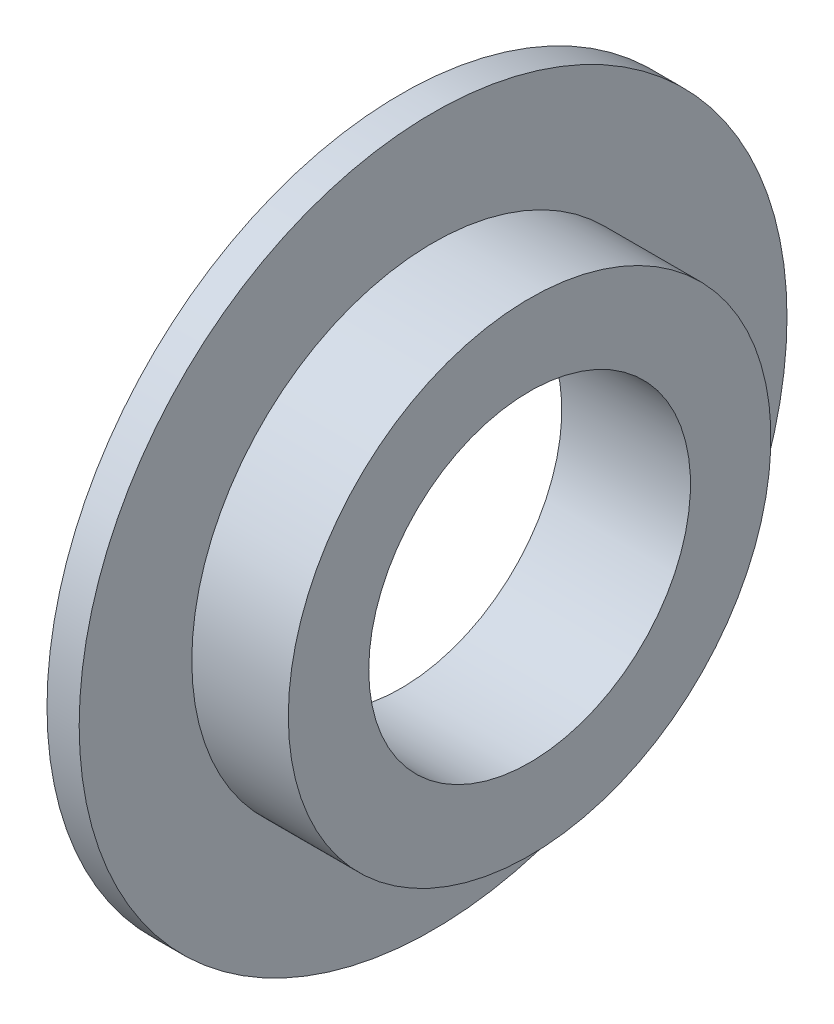
ISO-10303-21;
HEADER;
FILE_DESCRIPTION(('STEP AP214'),'2;1');
FILE_NAME('part.step','',(''),(''),'','','');
FILE_SCHEMA(('AUTOMOTIVE_DESIGN { 1 0 10303 214 1 1 1 1 }'));
ENDSEC;
DATA;
#1=APPLICATION_CONTEXT('core data for automotive mechanical design processes');
#2=APPLICATION_PROTOCOL_DEFINITION('international standard','automotive_design',2000,#1);
#3=PRODUCT_CONTEXT('',#1,'mechanical');
#4=PRODUCT('Part','Part','',(#3));
#5=PRODUCT_RELATED_PRODUCT_CATEGORY('part','',(#4));
#6=PRODUCT_DEFINITION_FORMATION('','',#4);
#7=PRODUCT_DEFINITION_CONTEXT('part definition',#1,'design');
#8=PRODUCT_DEFINITION('design','',#6,#7);
#9=PRODUCT_DEFINITION_SHAPE('','',#8);
#10=(LENGTH_UNIT() NAMED_UNIT(*) SI_UNIT(.MILLI.,.METRE.));
#11=(NAMED_UNIT(*) PLANE_ANGLE_UNIT() SI_UNIT($,.RADIAN.));
#12=(NAMED_UNIT(*) SI_UNIT($,.STERADIAN.) SOLID_ANGLE_UNIT());
#13=UNCERTAINTY_MEASURE_WITH_UNIT(LENGTH_MEASURE(1.E-05),#10,'distance_accuracy_value','');
#14=(GEOMETRIC_REPRESENTATION_CONTEXT(3) GLOBAL_UNCERTAINTY_ASSIGNED_CONTEXT((#13)) GLOBAL_UNIT_ASSIGNED_CONTEXT((#10,
#11,#12)) REPRESENTATION_CONTEXT('',''));
#15=CARTESIAN_POINT('',(0.,0.,0.));
#16=DIRECTION('',(0.,0.,1.));
#17=DIRECTION('',(1.,0.,0.));
#18=AXIS2_PLACEMENT_3D('',#15,#16,#17);
#19=CARTESIAN_POINT('',(4.,0.,0.));
#20=DIRECTION('',(1.,0.,0.));
#21=DIRECTION('',(0.,0.,-1.));
#22=AXIS2_PLACEMENT_3D('',#19,#20,#21);
#23=PLANE('',#22);
#24=CARTESIAN_POINT('',(4.,0.,0.));
#25=DIRECTION('',(-1.,0.,0.));
#26=DIRECTION('',(0.,0.,1.));
#27=AXIS2_PLACEMENT_3D('',#24,#25,#26);
#28=CIRCLE('',#27,5.);
#29=CARTESIAN_POINT('',(4.,0.,5.));
#30=VERTEX_POINT('',#29);
#31=EDGE_CURVE('E59',#30,#30,#28,.T.);
#32=ORIENTED_EDGE('',*,*,#31,.T.);
#33=EDGE_LOOP('',(#32));
#34=FACE_BOUND('',#33,.T.);
#35=CARTESIAN_POINT('',(4.,0.,0.));
#36=DIRECTION('',(-1.,0.,0.));
#37=DIRECTION('',(0.,0.,1.));
#38=AXIS2_PLACEMENT_3D('',#35,#36,#37);
#39=CIRCLE('',#38,7.5);
#40=CARTESIAN_POINT('',(4.,0.,7.5));
#41=VERTEX_POINT('',#40);
#42=EDGE_CURVE('E10',#41,#41,#39,.T.);
#43=ORIENTED_EDGE('',*,*,#42,.F.);
#44=EDGE_LOOP('',(#43));
#45=FACE_BOUND('',#44,.T.);
#46=ADVANCED_FACE('F37',(#34,#45),#23,.T.);
#47=CARTESIAN_POINT('',(-7.62943857206152,0.,0.));
#48=DIRECTION('',(-1.,0.,0.));
#49=DIRECTION('',(0.,0.,1.));
#50=AXIS2_PLACEMENT_3D('',#47,#48,#49);
#51=CYLINDRICAL_SURFACE('',#50,7.5);
#52=ORIENTED_EDGE('',*,*,#42,.T.);
#53=EDGE_LOOP('',(#52));
#54=FACE_BOUND('',#53,.T.);
#55=CARTESIAN_POINT('',(0.999999999999998,0.,0.));
#56=DIRECTION('',(-1.,0.,0.));
#57=DIRECTION('',(0.,0.,1.));
#58=AXIS2_PLACEMENT_3D('',#55,#56,#57);
#59=CIRCLE('',#58,7.5);
#60=CARTESIAN_POINT('',(0.999999999999998,0.,7.5));
#61=VERTEX_POINT('',#60);
#62=EDGE_CURVE('E43',#61,#61,#59,.T.);
#63=ORIENTED_EDGE('',*,*,#62,.F.);
#64=EDGE_LOOP('',(#63));
#65=FACE_BOUND('',#64,.T.);
#66=ADVANCED_FACE('F85',(#54,#65),#51,.T.);
#67=CARTESIAN_POINT('',(0.999999999999999,0.,0.));
#68=DIRECTION('',(1.,0.,0.));
#69=DIRECTION('',(0.,0.,-1.));
#70=AXIS2_PLACEMENT_3D('',#67,#68,#69);
#71=PLANE('',#70);
#72=ORIENTED_EDGE('',*,*,#62,.T.);
#73=EDGE_LOOP('',(#72));
#74=FACE_BOUND('',#73,.T.);
#75=CARTESIAN_POINT('',(0.999999999999998,0.,0.));
#76=DIRECTION('',(-1.,0.,0.));
#77=DIRECTION('',(0.,0.,1.));
#78=AXIS2_PLACEMENT_3D('',#75,#76,#77);
#79=CIRCLE('',#78,11.);
#80=CARTESIAN_POINT('',(0.999999999999998,0.,11.));
#81=VERTEX_POINT('',#80);
#82=EDGE_CURVE('E47',#81,#81,#79,.T.);
#83=ORIENTED_EDGE('',*,*,#82,.F.);
#84=EDGE_LOOP('',(#83));
#85=FACE_BOUND('',#84,.T.);
#86=ADVANCED_FACE('F79',(#74,#85),#71,.T.);
#87=CARTESIAN_POINT('',(-7.62943857206152,0.,0.));
#88=DIRECTION('',(-1.,0.,0.));
#89=DIRECTION('',(0.,0.,1.));
#90=AXIS2_PLACEMENT_3D('',#87,#88,#89);
#91=CYLINDRICAL_SURFACE('',#90,11.);
#92=ORIENTED_EDGE('',*,*,#82,.T.);
#93=EDGE_LOOP('',(#92));
#94=FACE_BOUND('',#93,.T.);
#95=CARTESIAN_POINT('',(0.,0.,0.));
#96=DIRECTION('',(-1.,0.,0.));
#97=DIRECTION('',(0.,0.,1.));
#98=AXIS2_PLACEMENT_3D('',#95,#96,#97);
#99=CIRCLE('',#98,11.);
#100=CARTESIAN_POINT('',(0.,0.,11.));
#101=VERTEX_POINT('',#100);
#102=EDGE_CURVE('E51',#101,#101,#99,.T.);
#103=ORIENTED_EDGE('',*,*,#102,.F.);
#104=EDGE_LOOP('',(#103));
#105=FACE_BOUND('',#104,.T.);
#106=ADVANCED_FACE('F74',(#94,#105),#91,.T.);
#107=CARTESIAN_POINT('',(0.,0.,0.));
#108=DIRECTION('',(1.,0.,0.));
#109=DIRECTION('',(0.,0.,-1.));
#110=AXIS2_PLACEMENT_3D('',#107,#108,#109);
#111=PLANE('',#110);
#112=CARTESIAN_POINT('',(0.,0.,0.));
#113=DIRECTION('',(-1.,0.,0.));
#114=DIRECTION('',(0.,0.,1.));
#115=AXIS2_PLACEMENT_3D('',#112,#113,#114);
#116=CIRCLE('',#115,5.);
#117=CARTESIAN_POINT('',(0.,0.,5.));
#118=VERTEX_POINT('',#117);
#119=EDGE_CURVE('E56',#118,#118,#116,.T.);
#120=ORIENTED_EDGE('',*,*,#119,.F.);
#121=EDGE_LOOP('',(#120));
#122=FACE_BOUND('',#121,.T.);
#123=ORIENTED_EDGE('',*,*,#102,.T.);
#124=EDGE_LOOP('',(#123));
#125=FACE_BOUND('',#124,.T.);
#126=ADVANCED_FACE('F68',(#122,#125),#111,.F.);
#127=CARTESIAN_POINT('',(-7.62943857206152,0.,0.));
#128=DIRECTION('',(-1.,0.,0.));
#129=DIRECTION('',(0.,0.,1.));
#130=AXIS2_PLACEMENT_3D('',#127,#128,#129);
#131=CYLINDRICAL_SURFACE('',#130,5.);
#132=ORIENTED_EDGE('',*,*,#31,.F.);
#133=EDGE_LOOP('',(#132));
#134=FACE_BOUND('',#133,.T.);
#135=ORIENTED_EDGE('',*,*,#119,.T.);
#136=EDGE_LOOP('',(#135));
#137=FACE_BOUND('',#136,.T.);
#138=ADVANCED_FACE('F65',(#134,#137),#131,.F.);
#139=CLOSED_SHELL('',(#46,#66,#86,#106,#126,#138));
#140=MANIFOLD_SOLID_BREP('B2',#139);
#141=ADVANCED_BREP_SHAPE_REPRESENTATION('',(#18,#140),#14);
#142=SHAPE_DEFINITION_REPRESENTATION(#9,#141);
ENDSEC;
END-ISO-10303-21;
